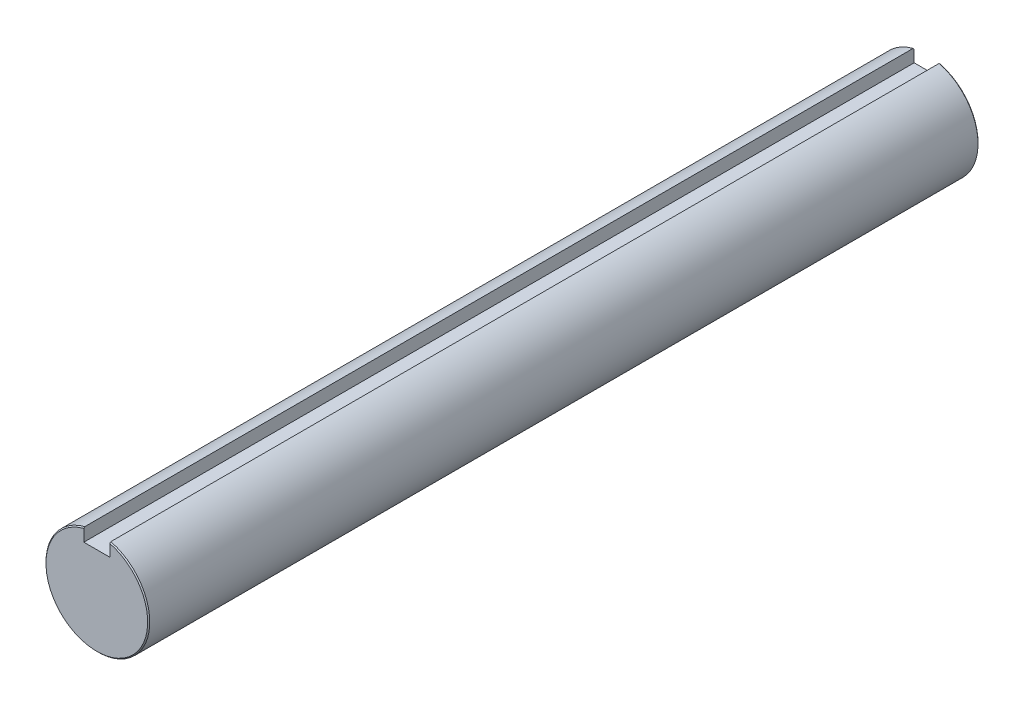
ISO-10303-21;
HEADER;
FILE_DESCRIPTION(('STEP AP214'),'2;1');
FILE_NAME('part.step','',(''),(''),'','','');
FILE_SCHEMA(('AUTOMOTIVE_DESIGN { 1 0 10303 214 1 1 1 1 }'));
ENDSEC;
DATA;
#1=APPLICATION_CONTEXT('core data for automotive mechanical design processes');
#2=APPLICATION_PROTOCOL_DEFINITION('international standard','automotive_design',2000,#1);
#3=PRODUCT_CONTEXT('',#1,'mechanical');
#4=PRODUCT('Part','Part','',(#3));
#5=PRODUCT_RELATED_PRODUCT_CATEGORY('part','',(#4));
#6=PRODUCT_DEFINITION_FORMATION('','',#4);
#7=PRODUCT_DEFINITION_CONTEXT('part definition',#1,'design');
#8=PRODUCT_DEFINITION('design','',#6,#7);
#9=PRODUCT_DEFINITION_SHAPE('','',#8);
#10=(LENGTH_UNIT() NAMED_UNIT(*) SI_UNIT(.MILLI.,.METRE.));
#11=(NAMED_UNIT(*) PLANE_ANGLE_UNIT() SI_UNIT($,.RADIAN.));
#12=(NAMED_UNIT(*) SI_UNIT($,.STERADIAN.) SOLID_ANGLE_UNIT());
#13=UNCERTAINTY_MEASURE_WITH_UNIT(LENGTH_MEASURE(1.E-05),#10,'distance_accuracy_value','');
#14=(GEOMETRIC_REPRESENTATION_CONTEXT(3) GLOBAL_UNCERTAINTY_ASSIGNED_CONTEXT((#13)) GLOBAL_UNIT_ASSIGNED_CONTEXT((#10,
#11,#12)) REPRESENTATION_CONTEXT('',''));
#15=CARTESIAN_POINT('',(0.,0.,0.));
#16=DIRECTION('',(0.,0.,1.));
#17=DIRECTION('',(1.,0.,0.));
#18=AXIS2_PLACEMENT_3D('',#15,#16,#17);
#19=CARTESIAN_POINT('',(0.,0.,38.1));
#20=DIRECTION('',(0.,0.,-1.));
#21=DIRECTION('',(-1.,0.,0.));
#22=AXIS2_PLACEMENT_3D('',#19,#20,#21);
#23=CYLINDRICAL_SURFACE('',#22,4.76249999999999);
#24=DIRECTION('',(0.,0.,-1.));
#25=VECTOR('',#24,1.);
#26=CARTESIAN_POINT('',(-1.1938,4.61044984898436,38.1));
#27=LINE('',#26,#25);
#28=CARTESIAN_POINT('',(-1.1938,4.61044984898436,38.00475));
#29=VERTEX_POINT('',#28);
#30=CARTESIAN_POINT('',(-1.1938,4.61044984898436,-38.0047499999999));
#31=VERTEX_POINT('',#30);
#32=EDGE_CURVE('E118',#29,#31,#27,.T.);
#33=ORIENTED_EDGE('',*,*,#32,.T.);
#34=CARTESIAN_POINT('',(0.,0.,-38.0047499999999));
#35=DIRECTION('',(0.,0.,1.));
#36=DIRECTION('',(1.,0.,0.));
#37=AXIS2_PLACEMENT_3D('',#34,#35,#36);
#38=CIRCLE('',#37,4.76249999999999);
#39=CARTESIAN_POINT('',(1.1938,4.61044984898436,-38.0047499999999));
#40=VERTEX_POINT('',#39);
#41=EDGE_CURVE('E125',#31,#40,#38,.T.);
#42=ORIENTED_EDGE('',*,*,#41,.T.);
#43=DIRECTION('',(0.,0.,-1.));
#44=VECTOR('',#43,1.);
#45=CARTESIAN_POINT('',(1.1938,4.61044984898436,38.1));
#46=LINE('',#45,#44);
#47=CARTESIAN_POINT('',(1.1938,4.61044984898436,38.00475));
#48=VERTEX_POINT('',#47);
#49=EDGE_CURVE('E105',#48,#40,#46,.T.);
#50=ORIENTED_EDGE('',*,*,#49,.F.);
#51=CARTESIAN_POINT('',(0.,0.,38.00475));
#52=DIRECTION('',(0.,0.,1.));
#53=DIRECTION('',(1.,0.,0.));
#54=AXIS2_PLACEMENT_3D('',#51,#52,#53);
#55=CIRCLE('',#54,4.76249999999999);
#56=EDGE_CURVE('E123',#48,#29,#55,.F.);
#57=ORIENTED_EDGE('',*,*,#56,.T.);
#58=EDGE_LOOP('',(#33,#42,#50,#57));
#59=FACE_BOUND('',#58,.T.);
#60=ADVANCED_FACE('F32',(#59),#23,.T.);
#61=CARTESIAN_POINT('',(1.1938,3.41664984898436,38.1));
#62=DIRECTION('',(1.,0.,0.));
#63=DIRECTION('',(0.,0.,-1.));
#64=AXIS2_PLACEMENT_3D('',#61,#62,#63);
#65=PLANE('',#64);
#66=ORIENTED_EDGE('',*,*,#49,.T.);
#67=CARTESIAN_POINT('',(1.1938,4.61044984898436,-38.0047499999999));
#68=CARTESIAN_POINT('',(1.1938,4.59404555537123,-38.0206306747581));
#69=CARTESIAN_POINT('',(1.1938,4.57763851684495,-38.0365085121347));
#70=CARTESIAN_POINT('',(1.1938,4.54481894995614,-38.0682585121347));
#71=CARTESIAN_POINT('',(1.1938,4.52840642159362,-38.0841306747581));
#72=CARTESIAN_POINT('',(1.1938,4.51199114831794,-38.1));
#73=B_SPLINE_CURVE_WITH_KNOTS('',3,(#67,#68,#69,#70,#71,#72),.UNSPECIFIED.,.F.,.F.,(4,2,4),(0.,
0.0684957640782738,0.136991528197922),.UNSPECIFIED.);
#74=CARTESIAN_POINT('',(1.1938,4.51199114831794,-38.1));
#75=VERTEX_POINT('',#74);
#76=EDGE_CURVE('E96',#40,#75,#73,.T.);
#77=ORIENTED_EDGE('',*,*,#76,.T.);
#78=DIRECTION('',(0.,-1.,0.));
#79=VECTOR('',#78,1.);
#80=CARTESIAN_POINT('',(1.1938,3.41664984898436,-38.1));
#81=LINE('',#80,#79);
#82=CARTESIAN_POINT('',(1.1938,3.41664984898436,-38.1));
#83=VERTEX_POINT('',#82);
#84=EDGE_CURVE('E89',#75,#83,#81,.T.);
#85=ORIENTED_EDGE('',*,*,#84,.T.);
#86=DIRECTION('',(0.,0.,-1.));
#87=VECTOR('',#86,1.);
#88=CARTESIAN_POINT('',(1.1938,3.41664984898436,38.1));
#89=LINE('',#88,#87);
#90=CARTESIAN_POINT('',(1.1938,3.41664984898436,38.1));
#91=VERTEX_POINT('',#90);
#92=EDGE_CURVE('E94',#91,#83,#89,.T.);
#93=ORIENTED_EDGE('',*,*,#92,.F.);
#94=DIRECTION('',(0.,-1.,0.));
#95=VECTOR('',#94,1.);
#96=CARTESIAN_POINT('',(1.1938,3.41664984898436,38.1));
#97=LINE('',#96,#95);
#98=CARTESIAN_POINT('',(1.1938,4.51199114831804,38.1));
#99=VERTEX_POINT('',#98);
#100=EDGE_CURVE('E111',#99,#91,#97,.T.);
#101=ORIENTED_EDGE('',*,*,#100,.F.);
#102=CARTESIAN_POINT('',(1.1938,4.51199114831804,38.1));
#103=CARTESIAN_POINT('',(1.1938,4.52840642159371,38.0841306747581));
#104=CARTESIAN_POINT('',(1.1938,4.54481894995621,38.0682585121348));
#105=CARTESIAN_POINT('',(1.1938,4.57763851684498,38.0365085121348));
#106=CARTESIAN_POINT('',(1.1938,4.59404555537125,38.0206306747581));
#107=CARTESIAN_POINT('',(1.1938,4.61044984898437,38.00475));
#108=B_SPLINE_CURVE_WITH_KNOTS('',3,(#102,#103,#104,#105,#106,#107),.UNSPECIFIED.,.F.,.F.,(4,2,
4),(0.,0.0684957641195721,0.136991528197778),.UNSPECIFIED.);
#109=EDGE_CURVE('E128',#99,#48,#108,.T.);
#110=ORIENTED_EDGE('',*,*,#109,.T.);
#111=EDGE_LOOP('',(#66,#77,#85,#93,#101,#110));
#112=FACE_BOUND('',#111,.T.);
#113=ADVANCED_FACE('F92',(#112),#65,.F.);
#114=CARTESIAN_POINT('',(1.1938,3.41664984898436,38.1));
#115=DIRECTION('',(0.,-1.,0.));
#116=DIRECTION('',(0.,0.,-1.));
#117=AXIS2_PLACEMENT_3D('',#114,#115,#116);
#118=PLANE('',#117);
#119=ORIENTED_EDGE('',*,*,#92,.T.);
#120=DIRECTION('',(-1.,0.,0.));
#121=VECTOR('',#120,1.);
#122=CARTESIAN_POINT('',(1.1938,3.41664984898436,-38.1));
#123=LINE('',#122,#121);
#124=CARTESIAN_POINT('',(-1.1938,3.41664984898436,-38.1));
#125=VERTEX_POINT('',#124);
#126=EDGE_CURVE('E98',#83,#125,#123,.T.);
#127=ORIENTED_EDGE('',*,*,#126,.T.);
#128=DIRECTION('',(0.,0.,-1.));
#129=VECTOR('',#128,1.);
#130=CARTESIAN_POINT('',(-1.1938,3.41664984898436,38.1));
#131=LINE('',#130,#129);
#132=CARTESIAN_POINT('',(-1.1938,3.41664984898436,38.1));
#133=VERTEX_POINT('',#132);
#134=EDGE_CURVE('E106',#133,#125,#131,.T.);
#135=ORIENTED_EDGE('',*,*,#134,.F.);
#136=DIRECTION('',(-1.,0.,0.));
#137=VECTOR('',#136,1.);
#138=CARTESIAN_POINT('',(1.1938,3.41664984898436,38.1));
#139=LINE('',#138,#137);
#140=EDGE_CURVE('E104',#91,#133,#139,.T.);
#141=ORIENTED_EDGE('',*,*,#140,.F.);
#142=EDGE_LOOP('',(#119,#127,#135,#141));
#143=FACE_BOUND('',#142,.T.);
#144=ADVANCED_FACE('F102',(#143),#118,.F.);
#145=CARTESIAN_POINT('',(-1.1938,3.41664984898436,38.1));
#146=DIRECTION('',(-1.,0.,0.));
#147=DIRECTION('',(0.,0.,1.));
#148=AXIS2_PLACEMENT_3D('',#145,#146,#147);
#149=PLANE('',#148);
#150=DIRECTION('',(0.,1.,0.));
#151=VECTOR('',#150,1.);
#152=CARTESIAN_POINT('',(-1.1938,3.41664984898436,-38.1));
#153=LINE('',#152,#151);
#154=CARTESIAN_POINT('',(-1.1938,4.51199114831794,-38.1));
#155=VERTEX_POINT('',#154);
#156=EDGE_CURVE('E109',#125,#155,#153,.T.);
#157=ORIENTED_EDGE('',*,*,#156,.T.);
#158=CARTESIAN_POINT('',(-1.1938,4.51199114831794,-38.1));
#159=CARTESIAN_POINT('',(-1.1938,4.52840642159362,-38.0841306747581));
#160=CARTESIAN_POINT('',(-1.1938,4.54481894995614,-38.0682585121347));
#161=CARTESIAN_POINT('',(-1.1938,4.57763851684495,-38.0365085121347));
#162=CARTESIAN_POINT('',(-1.1938,4.59404555537123,-38.0206306747581));
#163=CARTESIAN_POINT('',(-1.1938,4.61044984898436,-38.0047499999999));
#164=B_SPLINE_CURVE_WITH_KNOTS('',3,(#158,#159,#160,#161,#162,#163),.UNSPECIFIED.,.F.,.F.,(4,2,
4),(0.,0.0684957641196481,0.136991528197921),.UNSPECIFIED.);
#165=EDGE_CURVE('E41',#155,#31,#164,.T.);
#166=ORIENTED_EDGE('',*,*,#165,.T.);
#167=ORIENTED_EDGE('',*,*,#32,.F.);
#168=CARTESIAN_POINT('',(-1.1938,4.61044984898436,38.00475));
#169=CARTESIAN_POINT('',(-1.1938,4.59404555537125,38.0206306747581));
#170=CARTESIAN_POINT('',(-1.1938,4.57763851684498,38.0365085121348));
#171=CARTESIAN_POINT('',(-1.1938,4.54481894995621,38.0682585121348));
#172=CARTESIAN_POINT('',(-1.1938,4.52840642159371,38.0841306747581));
#173=CARTESIAN_POINT('',(-1.1938,4.51199114831804,38.1));
#174=B_SPLINE_CURVE_WITH_KNOTS('',3,(#168,#169,#170,#171,#172,#173),.UNSPECIFIED.,.F.,.F.,(4,2,
4),(0.,0.0684957640782051,0.136991528197777),.UNSPECIFIED.);
#175=CARTESIAN_POINT('',(-1.1938,4.51199114831804,38.1));
#176=VERTEX_POINT('',#175);
#177=EDGE_CURVE('E48',#29,#176,#174,.T.);
#178=ORIENTED_EDGE('',*,*,#177,.T.);
#179=DIRECTION('',(0.,1.,0.));
#180=VECTOR('',#179,1.);
#181=CARTESIAN_POINT('',(-1.1938,3.41664984898436,38.1));
#182=LINE('',#181,#180);
#183=EDGE_CURVE('E116',#133,#176,#182,.T.);
#184=ORIENTED_EDGE('',*,*,#183,.F.);
#185=ORIENTED_EDGE('',*,*,#134,.T.);
#186=EDGE_LOOP('',(#157,#166,#167,#178,#184,#185));
#187=FACE_BOUND('',#186,.T.);
#188=ADVANCED_FACE('F162',(#187),#149,.F.);
#189=CARTESIAN_POINT('',(0.,0.,38.1));
#190=DIRECTION('',(0.,0.,1.));
#191=DIRECTION('',(1.,0.,0.));
#192=AXIS2_PLACEMENT_3D('',#189,#190,#191);
#193=PLANE('',#192);
#194=ORIENTED_EDGE('',*,*,#183,.T.);
#195=CARTESIAN_POINT('',(0.,0.,38.1));
#196=DIRECTION('',(0.,0.,1.));
#197=DIRECTION('',(1.,0.,0.));
#198=AXIS2_PLACEMENT_3D('',#195,#196,#197);
#199=CIRCLE('',#198,4.66725000000004);
#200=EDGE_CURVE('E11',#176,#99,#199,.T.);
#201=ORIENTED_EDGE('',*,*,#200,.T.);
#202=ORIENTED_EDGE('',*,*,#100,.T.);
#203=ORIENTED_EDGE('',*,*,#140,.T.);
#204=EDGE_LOOP('',(#194,#201,#202,#203));
#205=FACE_BOUND('',#204,.T.);
#206=ADVANCED_FACE('F166',(#205),#193,.T.);
#207=CARTESIAN_POINT('',(0.,0.,-38.1));
#208=DIRECTION('',(0.,0.,1.));
#209=DIRECTION('',(1.,0.,0.));
#210=AXIS2_PLACEMENT_3D('',#207,#208,#209);
#211=PLANE('',#210);
#212=ORIENTED_EDGE('',*,*,#84,.F.);
#213=CARTESIAN_POINT('',(0.,0.,-38.1));
#214=DIRECTION('',(0.,0.,1.));
#215=DIRECTION('',(1.,0.,0.));
#216=AXIS2_PLACEMENT_3D('',#213,#214,#215);
#217=CIRCLE('',#216,4.66724999999994);
#218=EDGE_CURVE('E56',#75,#155,#217,.F.);
#219=ORIENTED_EDGE('',*,*,#218,.T.);
#220=ORIENTED_EDGE('',*,*,#156,.F.);
#221=ORIENTED_EDGE('',*,*,#126,.F.);
#222=EDGE_LOOP('',(#212,#219,#220,#221));
#223=FACE_BOUND('',#222,.T.);
#224=ADVANCED_FACE('F108',(#223),#211,.F.);
#225=CARTESIAN_POINT('',(0.,0.,-38.0047499999999));
#226=DIRECTION('',(0.,0.,1.));
#227=DIRECTION('',(1.,0.,0.));
#228=AXIS2_PLACEMENT_3D('',#225,#226,#227);
#229=CONICAL_SURFACE('',#228,4.76249999999999,0.785398163397407);
#230=ORIENTED_EDGE('',*,*,#165,.F.);
#231=ORIENTED_EDGE('',*,*,#218,.F.);
#232=ORIENTED_EDGE('',*,*,#76,.F.);
#233=ORIENTED_EDGE('',*,*,#41,.F.);
#234=EDGE_LOOP('',(#230,#231,#232,#233));
#235=FACE_BOUND('',#234,.T.);
#236=ADVANCED_FACE('F148',(#235),#229,.T.);
#237=CARTESIAN_POINT('',(0.,0.,38.1));
#238=DIRECTION('',(0.,0.,-1.));
#239=DIRECTION('',(-1.,0.,0.));
#240=AXIS2_PLACEMENT_3D('',#237,#238,#239);
#241=CONICAL_SURFACE('',#240,4.66725000000004,0.785398163397444);
#242=ORIENTED_EDGE('',*,*,#177,.F.);
#243=ORIENTED_EDGE('',*,*,#56,.F.);
#244=ORIENTED_EDGE('',*,*,#109,.F.);
#245=ORIENTED_EDGE('',*,*,#200,.F.);
#246=EDGE_LOOP('',(#242,#243,#244,#245));
#247=FACE_BOUND('',#246,.T.);
#248=ADVANCED_FACE('F34',(#247),#241,.T.);
#249=CLOSED_SHELL('',(#60,#113,#144,#188,#206,#224,#236,#248));
#250=MANIFOLD_SOLID_BREP('B2',#249);
#251=ADVANCED_BREP_SHAPE_REPRESENTATION('',(#18,#250),#14);
#252=SHAPE_DEFINITION_REPRESENTATION(#9,#251);
ENDSEC;
END-ISO-10303-21;
